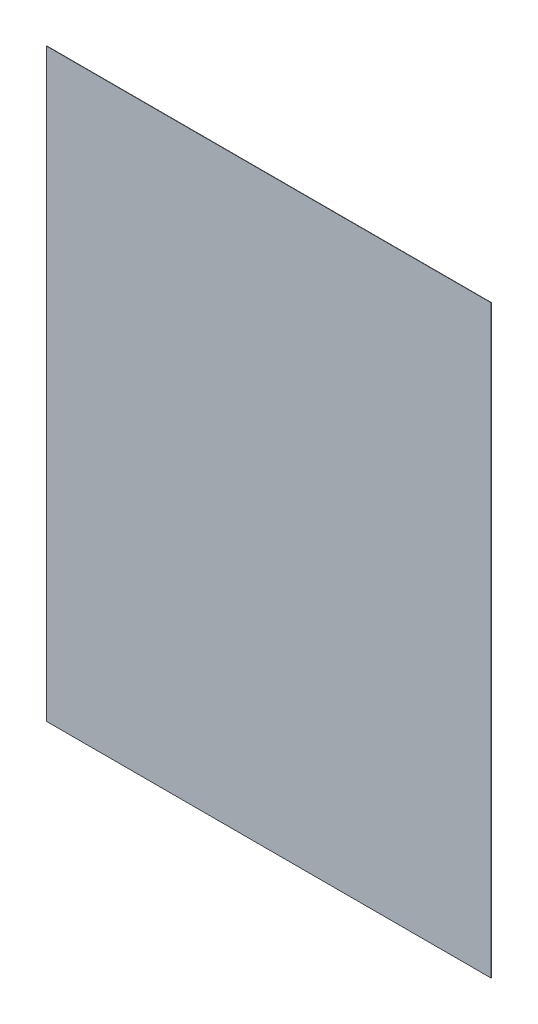
ISO-10303-21;
HEADER;
FILE_DESCRIPTION(('STEP AP214'),'2;1');
FILE_NAME('part.step','',(''),(''),'','','');
FILE_SCHEMA(('AUTOMOTIVE_DESIGN { 1 0 10303 214 1 1 1 1 }'));
ENDSEC;
DATA;
#1=APPLICATION_CONTEXT('core data for automotive mechanical design processes');
#2=APPLICATION_PROTOCOL_DEFINITION('international standard','automotive_design',2000,#1);
#3=PRODUCT_CONTEXT('',#1,'mechanical');
#4=PRODUCT('Part','Part','',(#3));
#5=PRODUCT_RELATED_PRODUCT_CATEGORY('part','',(#4));
#6=PRODUCT_DEFINITION_FORMATION('','',#4);
#7=PRODUCT_DEFINITION_CONTEXT('part definition',#1,'design');
#8=PRODUCT_DEFINITION('design','',#6,#7);
#9=PRODUCT_DEFINITION_SHAPE('','',#8);
#10=(LENGTH_UNIT() NAMED_UNIT(*) SI_UNIT(.MILLI.,.METRE.));
#11=(NAMED_UNIT(*) PLANE_ANGLE_UNIT() SI_UNIT($,.RADIAN.));
#12=(NAMED_UNIT(*) SI_UNIT($,.STERADIAN.) SOLID_ANGLE_UNIT());
#13=UNCERTAINTY_MEASURE_WITH_UNIT(LENGTH_MEASURE(1.E-05),#10,'distance_accuracy_value','');
#14=(GEOMETRIC_REPRESENTATION_CONTEXT(3) GLOBAL_UNCERTAINTY_ASSIGNED_CONTEXT((#13)) GLOBAL_UNIT_ASSIGNED_CONTEXT((#10,
#11,#12)) REPRESENTATION_CONTEXT('',''));
#15=CARTESIAN_POINT('',(0.,0.,0.));
#16=DIRECTION('',(0.,0.,1.));
#17=DIRECTION('',(1.,0.,0.));
#18=AXIS2_PLACEMENT_3D('',#15,#16,#17);
#19=CARTESIAN_POINT('',(78.05,102.75,0.112));
#20=DIRECTION('',(-1.,0.,0.));
#21=DIRECTION('',(0.,-1.,0.));
#22=AXIS2_PLACEMENT_3D('',#19,#20,#21);
#23=PLANE('',#22);
#24=DIRECTION('',(0.,1.,0.));
#25=VECTOR('',#24,1.);
#26=CARTESIAN_POINT('',(78.05,102.75,0.));
#27=LINE('',#26,#25);
#28=CARTESIAN_POINT('',(78.05,-102.75,0.));
#29=VERTEX_POINT('',#28);
#30=CARTESIAN_POINT('',(78.05,102.75,0.));
#31=VERTEX_POINT('',#30);
#32=EDGE_CURVE('E97',#29,#31,#27,.T.);
#33=ORIENTED_EDGE('',*,*,#32,.T.);
#34=DIRECTION('',(0.,0.,-1.));
#35=VECTOR('',#34,1.);
#36=CARTESIAN_POINT('',(78.05,102.75,0.112));
#37=LINE('',#36,#35);
#38=CARTESIAN_POINT('',(78.05,102.75,0.112));
#39=VERTEX_POINT('',#38);
#40=EDGE_CURVE('E11',#39,#31,#37,.T.);
#41=ORIENTED_EDGE('',*,*,#40,.F.);
#42=DIRECTION('',(0.,1.,0.));
#43=VECTOR('',#42,1.);
#44=CARTESIAN_POINT('',(78.05,102.75,0.112));
#45=LINE('',#44,#43);
#46=CARTESIAN_POINT('',(78.05,-102.75,0.112));
#47=VERTEX_POINT('',#46);
#48=EDGE_CURVE('E85',#47,#39,#45,.T.);
#49=ORIENTED_EDGE('',*,*,#48,.F.);
#50=DIRECTION('',(0.,0.,-1.));
#51=VECTOR('',#50,1.);
#52=CARTESIAN_POINT('',(78.05,-102.75,0.112));
#53=LINE('',#52,#51);
#54=EDGE_CURVE('E93',#47,#29,#53,.T.);
#55=ORIENTED_EDGE('',*,*,#54,.T.);
#56=EDGE_LOOP('',(#33,#41,#49,#55));
#57=FACE_BOUND('',#56,.T.);
#58=ADVANCED_FACE('F34',(#57),#23,.F.);
#59=CARTESIAN_POINT('',(-78.05,102.75,0.112));
#60=DIRECTION('',(0.,-1.,0.));
#61=DIRECTION('',(0.,0.,-1.));
#62=AXIS2_PLACEMENT_3D('',#59,#60,#61);
#63=PLANE('',#62);
#64=DIRECTION('',(-1.,0.,0.));
#65=VECTOR('',#64,1.);
#66=CARTESIAN_POINT('',(-78.05,102.75,0.));
#67=LINE('',#66,#65);
#68=CARTESIAN_POINT('',(-78.05,102.75,0.));
#69=VERTEX_POINT('',#68);
#70=EDGE_CURVE('E89',#31,#69,#67,.T.);
#71=ORIENTED_EDGE('',*,*,#70,.T.);
#72=DIRECTION('',(0.,0.,-1.));
#73=VECTOR('',#72,1.);
#74=CARTESIAN_POINT('',(-78.05,102.75,0.112));
#75=LINE('',#74,#73);
#76=CARTESIAN_POINT('',(-78.05,102.75,0.112));
#77=VERTEX_POINT('',#76);
#78=EDGE_CURVE('E42',#77,#69,#75,.T.);
#79=ORIENTED_EDGE('',*,*,#78,.F.);
#80=DIRECTION('',(-1.,0.,0.));
#81=VECTOR('',#80,1.);
#82=CARTESIAN_POINT('',(-78.05,102.75,0.112));
#83=LINE('',#82,#81);
#84=EDGE_CURVE('E80',#39,#77,#83,.T.);
#85=ORIENTED_EDGE('',*,*,#84,.F.);
#86=ORIENTED_EDGE('',*,*,#40,.T.);
#87=EDGE_LOOP('',(#71,#79,#85,#86));
#88=FACE_BOUND('',#87,.T.);
#89=ADVANCED_FACE('F88',(#88),#63,.F.);
#90=CARTESIAN_POINT('',(-78.05,102.75,0.112));
#91=DIRECTION('',(1.,0.,0.));
#92=DIRECTION('',(0.,1.,0.));
#93=AXIS2_PLACEMENT_3D('',#90,#91,#92);
#94=PLANE('',#93);
#95=DIRECTION('',(0.,-1.,0.));
#96=VECTOR('',#95,1.);
#97=CARTESIAN_POINT('',(-78.05,102.75,0.));
#98=LINE('',#97,#96);
#99=CARTESIAN_POINT('',(-78.05,-102.75,0.));
#100=VERTEX_POINT('',#99);
#101=EDGE_CURVE('E67',#69,#100,#98,.T.);
#102=ORIENTED_EDGE('',*,*,#101,.T.);
#103=DIRECTION('',(0.,0.,-1.));
#104=VECTOR('',#103,1.);
#105=CARTESIAN_POINT('',(-78.05,-102.75,0.112));
#106=LINE('',#105,#104);
#107=CARTESIAN_POINT('',(-78.05,-102.75,0.112));
#108=VERTEX_POINT('',#107);
#109=EDGE_CURVE('E90',#108,#100,#106,.T.);
#110=ORIENTED_EDGE('',*,*,#109,.F.);
#111=DIRECTION('',(0.,-1.,0.));
#112=VECTOR('',#111,1.);
#113=CARTESIAN_POINT('',(-78.05,102.75,0.112));
#114=LINE('',#113,#112);
#115=EDGE_CURVE('E83',#77,#108,#114,.T.);
#116=ORIENTED_EDGE('',*,*,#115,.F.);
#117=ORIENTED_EDGE('',*,*,#78,.T.);
#118=EDGE_LOOP('',(#102,#110,#116,#117));
#119=FACE_BOUND('',#118,.T.);
#120=ADVANCED_FACE('F91',(#119),#94,.F.);
#121=CARTESIAN_POINT('',(-78.05,-102.75,0.112));
#122=DIRECTION('',(0.,1.,0.));
#123=DIRECTION('',(0.,0.,1.));
#124=AXIS2_PLACEMENT_3D('',#121,#122,#123);
#125=PLANE('',#124);
#126=DIRECTION('',(1.,0.,0.));
#127=VECTOR('',#126,1.);
#128=CARTESIAN_POINT('',(-78.05,-102.75,0.));
#129=LINE('',#128,#127);
#130=EDGE_CURVE('E73',#100,#29,#129,.T.);
#131=ORIENTED_EDGE('',*,*,#130,.T.);
#132=ORIENTED_EDGE('',*,*,#54,.F.);
#133=DIRECTION('',(1.,0.,0.));
#134=VECTOR('',#133,1.);
#135=CARTESIAN_POINT('',(-78.05,-102.75,0.112));
#136=LINE('',#135,#134);
#137=EDGE_CURVE('E50',#108,#47,#136,.T.);
#138=ORIENTED_EDGE('',*,*,#137,.F.);
#139=ORIENTED_EDGE('',*,*,#109,.T.);
#140=EDGE_LOOP('',(#131,#132,#138,#139));
#141=FACE_BOUND('',#140,.T.);
#142=ADVANCED_FACE('F104',(#141),#125,.F.);
#143=CARTESIAN_POINT('',(0.,0.,0.112));
#144=DIRECTION('',(0.,0.,1.));
#145=DIRECTION('',(1.,0.,0.));
#146=AXIS2_PLACEMENT_3D('',#143,#144,#145);
#147=PLANE('',#146);
#148=ORIENTED_EDGE('',*,*,#48,.T.);
#149=ORIENTED_EDGE('',*,*,#84,.T.);
#150=ORIENTED_EDGE('',*,*,#115,.T.);
#151=ORIENTED_EDGE('',*,*,#137,.T.);
#152=EDGE_LOOP('',(#148,#149,#150,#151));
#153=FACE_BOUND('',#152,.T.);
#154=ADVANCED_FACE('F81',(#153),#147,.T.);
#155=CARTESIAN_POINT('',(0.,0.,0.));
#156=DIRECTION('',(0.,0.,1.));
#157=DIRECTION('',(1.,0.,0.));
#158=AXIS2_PLACEMENT_3D('',#155,#156,#157);
#159=PLANE('',#158);
#160=ORIENTED_EDGE('',*,*,#32,.F.);
#161=ORIENTED_EDGE('',*,*,#130,.F.);
#162=ORIENTED_EDGE('',*,*,#101,.F.);
#163=ORIENTED_EDGE('',*,*,#70,.F.);
#164=EDGE_LOOP('',(#160,#161,#162,#163));
#165=FACE_BOUND('',#164,.T.);
#166=ADVANCED_FACE('F107',(#165),#159,.F.);
#167=CLOSED_SHELL('',(#58,#89,#120,#142,#154,#166));
#168=MANIFOLD_SOLID_BREP('B2',#167);
#169=ADVANCED_BREP_SHAPE_REPRESENTATION('',(#18,#168),#14);
#170=SHAPE_DEFINITION_REPRESENTATION(#9,#169);
ENDSEC;
END-ISO-10303-21;
